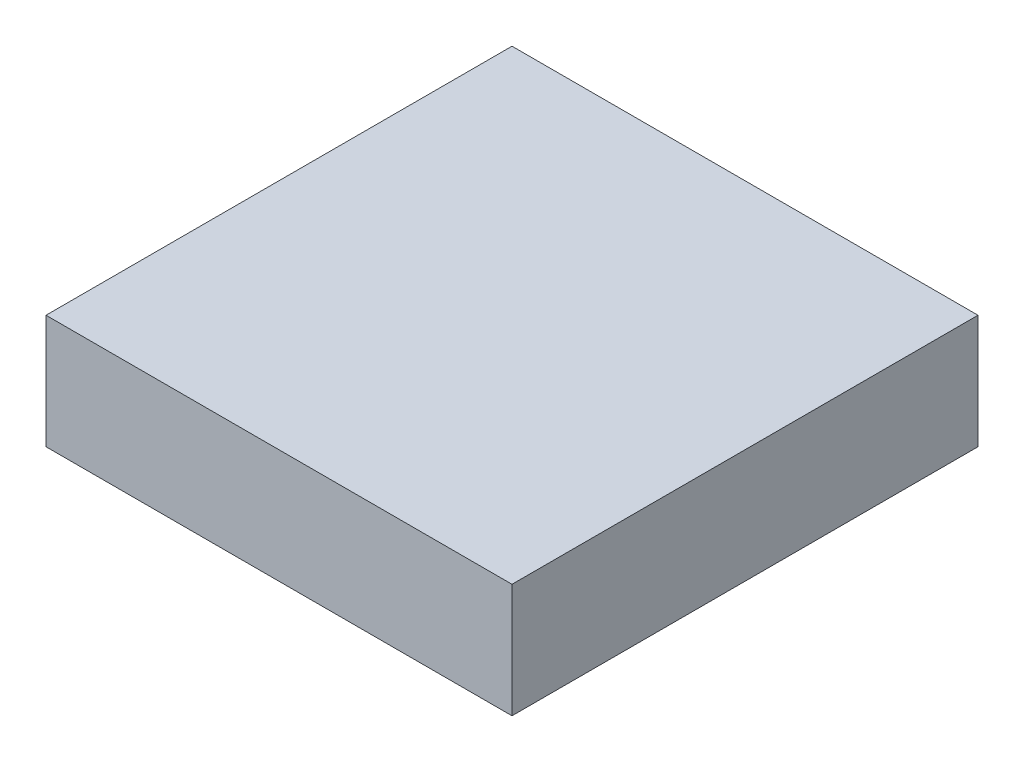
ISO-10303-21;
HEADER;
FILE_DESCRIPTION(('STEP AP214'),'2;1');
FILE_NAME('part.step','',(''),(''),'','','');
FILE_SCHEMA(('AUTOMOTIVE_DESIGN { 1 0 10303 214 1 1 1 1 }'));
ENDSEC;
DATA;
#1=APPLICATION_CONTEXT('core data for automotive mechanical design processes');
#2=APPLICATION_PROTOCOL_DEFINITION('international standard','automotive_design',2000,#1);
#3=PRODUCT_CONTEXT('',#1,'mechanical');
#4=PRODUCT('Part','Part','',(#3));
#5=PRODUCT_RELATED_PRODUCT_CATEGORY('part','',(#4));
#6=PRODUCT_DEFINITION_FORMATION('','',#4);
#7=PRODUCT_DEFINITION_CONTEXT('part definition',#1,'design');
#8=PRODUCT_DEFINITION('design','',#6,#7);
#9=PRODUCT_DEFINITION_SHAPE('','',#8);
#10=(LENGTH_UNIT() NAMED_UNIT(*) SI_UNIT(.MILLI.,.METRE.));
#11=(NAMED_UNIT(*) PLANE_ANGLE_UNIT() SI_UNIT($,.RADIAN.));
#12=(NAMED_UNIT(*) SI_UNIT($,.STERADIAN.) SOLID_ANGLE_UNIT());
#13=UNCERTAINTY_MEASURE_WITH_UNIT(LENGTH_MEASURE(1.E-05),#10,'distance_accuracy_value','');
#14=(GEOMETRIC_REPRESENTATION_CONTEXT(3) GLOBAL_UNCERTAINTY_ASSIGNED_CONTEXT((#13)) GLOBAL_UNIT_ASSIGNED_CONTEXT((#10,
#11,#12)) REPRESENTATION_CONTEXT('',''));
#15=CARTESIAN_POINT('',(0.,0.,0.));
#16=DIRECTION('',(0.,0.,1.));
#17=DIRECTION('',(1.,0.,0.));
#18=AXIS2_PLACEMENT_3D('',#15,#16,#17);
#19=CARTESIAN_POINT('',(36.4103047700791,101.601537824295,138.655146834317));
#20=DIRECTION('',(-1.,0.,0.));
#21=DIRECTION('',(0.,-1.,0.));
#22=AXIS2_PLACEMENT_3D('',#19,#20,#21);
#23=PLANE('',#22);
#24=DIRECTION('',(0.,-4.37113986981627E-08,-0.999999999999999));
#25=VECTOR('',#24,1.);
#26=CARTESIAN_POINT('',(36.4103047700791,99.4015378242946,138.655146930482));
#27=LINE('',#26,#25);
#28=CARTESIAN_POINT('',(36.4103047700791,99.4015382176972,147.655146930482));
#29=VERTEX_POINT('',#28);
#30=CARTESIAN_POINT('',(36.4103047700791,99.4015378242946,138.655146930482));
#31=VERTEX_POINT('',#30);
#32=EDGE_CURVE('E101',#29,#31,#27,.T.);
#33=ORIENTED_EDGE('',*,*,#32,.F.);
#34=DIRECTION('',(0.,-0.999999999999999,4.37113986981634E-08));
#35=VECTOR('',#34,1.);
#36=CARTESIAN_POINT('',(36.4103047700791,101.601538217697,147.655146834317));
#37=LINE('',#36,#35);
#38=CARTESIAN_POINT('',(36.4103047700791,101.601538217697,147.655146834317));
#39=VERTEX_POINT('',#38);
#40=EDGE_CURVE('E11',#39,#29,#37,.T.);
#41=ORIENTED_EDGE('',*,*,#40,.F.);
#42=DIRECTION('',(0.,-4.37113986981627E-08,-0.999999999999999));
#43=VECTOR('',#42,1.);
#44=CARTESIAN_POINT('',(36.4103047700791,101.601537824295,138.655146834317));
#45=LINE('',#44,#43);
#46=CARTESIAN_POINT('',(36.4103047700791,101.601537824295,138.655146834317));
#47=VERTEX_POINT('',#46);
#48=EDGE_CURVE('E95',#39,#47,#45,.T.);
#49=ORIENTED_EDGE('',*,*,#48,.T.);
#50=DIRECTION('',(0.,-0.999999999999999,4.37113986981634E-08));
#51=VECTOR('',#50,1.);
#52=CARTESIAN_POINT('',(36.4103047700791,101.601537824295,138.655146834317));
#53=LINE('',#52,#51);
#54=EDGE_CURVE('E40',#47,#31,#53,.T.);
#55=ORIENTED_EDGE('',*,*,#54,.T.);
#56=EDGE_LOOP('',(#33,#41,#49,#55));
#57=FACE_BOUND('',#56,.T.);
#58=ADVANCED_FACE('F37',(#57),#23,.T.);
#59=CARTESIAN_POINT('',(45.4103047700791,101.601538217697,147.655146834317));
#60=DIRECTION('',(0.,4.37113986981634E-08,0.999999999999999));
#61=DIRECTION('',(0.,-0.999999999999999,4.37113986981634E-08));
#62=AXIS2_PLACEMENT_3D('',#59,#60,#61);
#63=PLANE('',#62);
#64=DIRECTION('',(-1.,0.,0.));
#65=VECTOR('',#64,1.);
#66=CARTESIAN_POINT('',(45.4103047700791,99.4015382176973,147.655146930482));
#67=LINE('',#66,#65);
#68=CARTESIAN_POINT('',(45.4103047700791,99.4015382176973,147.655146930482));
#69=VERTEX_POINT('',#68);
#70=EDGE_CURVE('E97',#69,#29,#67,.T.);
#71=ORIENTED_EDGE('',*,*,#70,.F.);
#72=DIRECTION('',(0.,-0.999999999999999,4.37113986981634E-08));
#73=VECTOR('',#72,1.);
#74=CARTESIAN_POINT('',(45.4103047700791,101.601538217697,147.655146834317));
#75=LINE('',#74,#73);
#76=CARTESIAN_POINT('',(45.4103047700791,101.601538217697,147.655146834317));
#77=VERTEX_POINT('',#76);
#78=EDGE_CURVE('E46',#77,#69,#75,.T.);
#79=ORIENTED_EDGE('',*,*,#78,.F.);
#80=DIRECTION('',(-1.,0.,0.));
#81=VECTOR('',#80,1.);
#82=CARTESIAN_POINT('',(45.4103047700791,101.601538217697,147.655146834317));
#83=LINE('',#82,#81);
#84=EDGE_CURVE('E92',#77,#39,#83,.T.);
#85=ORIENTED_EDGE('',*,*,#84,.T.);
#86=ORIENTED_EDGE('',*,*,#40,.T.);
#87=EDGE_LOOP('',(#71,#79,#85,#86));
#88=FACE_BOUND('',#87,.T.);
#89=ADVANCED_FACE('F111',(#88),#63,.T.);
#90=CARTESIAN_POINT('',(45.4103047700791,101.601537824295,138.655146834317));
#91=DIRECTION('',(1.,0.,0.));
#92=DIRECTION('',(0.,1.,0.));
#93=AXIS2_PLACEMENT_3D('',#90,#91,#92);
#94=PLANE('',#93);
#95=DIRECTION('',(0.,4.37113986981627E-08,0.999999999999999));
#96=VECTOR('',#95,1.);
#97=CARTESIAN_POINT('',(45.4103047700791,99.4015378242947,138.655146930482));
#98=LINE('',#97,#96);
#99=CARTESIAN_POINT('',(45.4103047700791,99.4015378242947,138.655146930482));
#100=VERTEX_POINT('',#99);
#101=EDGE_CURVE('E87',#100,#69,#98,.T.);
#102=ORIENTED_EDGE('',*,*,#101,.F.);
#103=DIRECTION('',(0.,-0.999999999999999,4.37113986981634E-08));
#104=VECTOR('',#103,1.);
#105=CARTESIAN_POINT('',(45.4103047700791,101.601537824295,138.655146834317));
#106=LINE('',#105,#104);
#107=CARTESIAN_POINT('',(45.4103047700791,101.601537824295,138.655146834317));
#108=VERTEX_POINT('',#107);
#109=EDGE_CURVE('E82',#108,#100,#106,.T.);
#110=ORIENTED_EDGE('',*,*,#109,.F.);
#111=DIRECTION('',(0.,4.37113986981627E-08,0.999999999999999));
#112=VECTOR('',#111,1.);
#113=CARTESIAN_POINT('',(45.4103047700791,101.601537824295,138.655146834317));
#114=LINE('',#113,#112);
#115=EDGE_CURVE('E85',#108,#77,#114,.T.);
#116=ORIENTED_EDGE('',*,*,#115,.T.);
#117=ORIENTED_EDGE('',*,*,#78,.T.);
#118=EDGE_LOOP('',(#102,#110,#116,#117));
#119=FACE_BOUND('',#118,.T.);
#120=ADVANCED_FACE('F84',(#119),#94,.T.);
#121=CARTESIAN_POINT('',(45.4103047700791,101.601537824295,138.655146834317));
#122=DIRECTION('',(0.,-4.37113986981634E-08,-0.999999999999999));
#123=DIRECTION('',(0.,0.999999999999999,-4.37113986981634E-08));
#124=AXIS2_PLACEMENT_3D('',#121,#122,#123);
#125=PLANE('',#124);
#126=DIRECTION('',(1.,0.,0.));
#127=VECTOR('',#126,1.);
#128=CARTESIAN_POINT('',(45.4103047700791,99.4015378242947,138.655146930482));
#129=LINE('',#128,#127);
#130=EDGE_CURVE('E104',#31,#100,#129,.T.);
#131=ORIENTED_EDGE('',*,*,#130,.F.);
#132=ORIENTED_EDGE('',*,*,#54,.F.);
#133=DIRECTION('',(1.,0.,0.));
#134=VECTOR('',#133,1.);
#135=CARTESIAN_POINT('',(45.4103047700791,101.601537824295,138.655146834317));
#136=LINE('',#135,#134);
#137=EDGE_CURVE('E91',#47,#108,#136,.T.);
#138=ORIENTED_EDGE('',*,*,#137,.T.);
#139=ORIENTED_EDGE('',*,*,#109,.T.);
#140=EDGE_LOOP('',(#131,#132,#138,#139));
#141=FACE_BOUND('',#140,.T.);
#142=ADVANCED_FACE('F94',(#141),#125,.T.);
#143=CARTESIAN_POINT('',(-3.14956656904942E-13,101.601531763484,-4.44114506325769E-06));
#144=DIRECTION('',(0.,-0.999999999999999,4.37113986981627E-08));
#145=DIRECTION('',(0.,-4.37113986981627E-08,-0.999999999999999));
#146=AXIS2_PLACEMENT_3D('',#143,#144,#145);
#147=PLANE('',#146);
#148=ORIENTED_EDGE('',*,*,#48,.F.);
#149=ORIENTED_EDGE('',*,*,#84,.F.);
#150=ORIENTED_EDGE('',*,*,#115,.F.);
#151=ORIENTED_EDGE('',*,*,#137,.F.);
#152=EDGE_LOOP('',(#148,#149,#150,#151));
#153=FACE_BOUND('',#152,.T.);
#154=ADVANCED_FACE('F90',(#153),#147,.F.);
#155=CARTESIAN_POINT('',(-3.06549636796746E-13,99.4015317634839,-4.34497998612173E-06));
#156=DIRECTION('',(0.,-0.999999999999999,4.37113986981627E-08));
#157=DIRECTION('',(0.,-4.37113986981627E-08,-0.999999999999999));
#158=AXIS2_PLACEMENT_3D('',#155,#156,#157);
#159=PLANE('',#158);
#160=ORIENTED_EDGE('',*,*,#32,.T.);
#161=ORIENTED_EDGE('',*,*,#130,.T.);
#162=ORIENTED_EDGE('',*,*,#101,.T.);
#163=ORIENTED_EDGE('',*,*,#70,.T.);
#164=EDGE_LOOP('',(#160,#161,#162,#163));
#165=FACE_BOUND('',#164,.T.);
#166=ADVANCED_FACE('F110',(#165),#159,.T.);
#167=CLOSED_SHELL('',(#58,#89,#120,#142,#154,#166));
#168=MANIFOLD_SOLID_BREP('B2',#167);
#169=ADVANCED_BREP_SHAPE_REPRESENTATION('',(#18,#168),#14);
#170=SHAPE_DEFINITION_REPRESENTATION(#9,#169);
ENDSEC;
END-ISO-10303-21;
